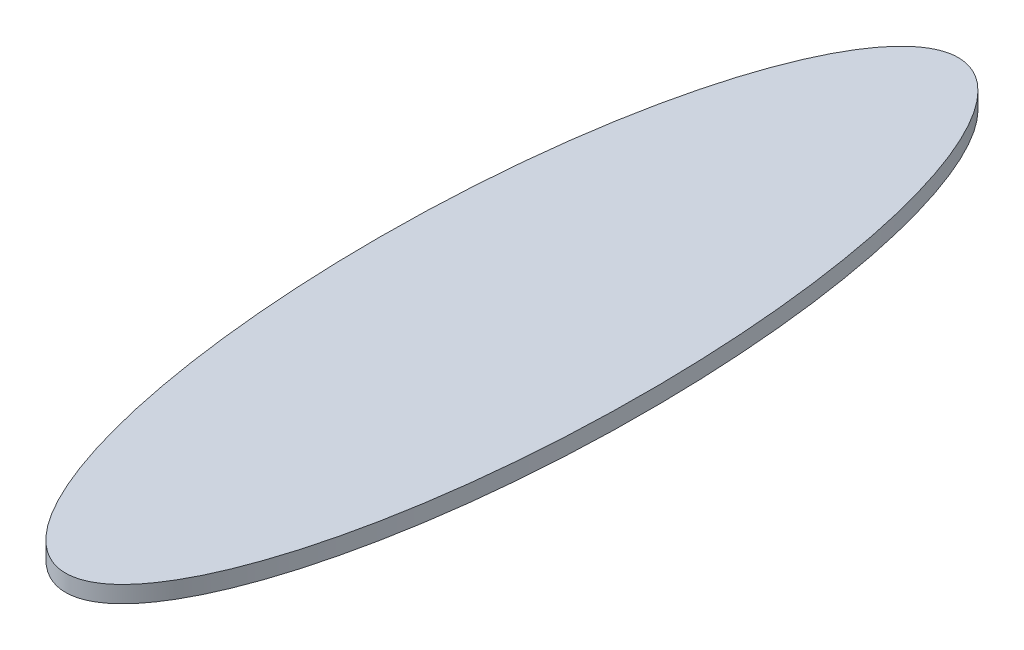
ISO-10303-21;
HEADER;
FILE_DESCRIPTION(('STEP AP214'),'2;1');
FILE_NAME('part.step','',(''),(''),'','','');
FILE_SCHEMA(('AUTOMOTIVE_DESIGN { 1 0 10303 214 1 1 1 1 }'));
ENDSEC;
DATA;
#1=APPLICATION_CONTEXT('core data for automotive mechanical design processes');
#2=APPLICATION_PROTOCOL_DEFINITION('international standard','automotive_design',2000,#1);
#3=PRODUCT_CONTEXT('',#1,'mechanical');
#4=PRODUCT('Part','Part','',(#3));
#5=PRODUCT_RELATED_PRODUCT_CATEGORY('part','',(#4));
#6=PRODUCT_DEFINITION_FORMATION('','',#4);
#7=PRODUCT_DEFINITION_CONTEXT('part definition',#1,'design');
#8=PRODUCT_DEFINITION('design','',#6,#7);
#9=PRODUCT_DEFINITION_SHAPE('','',#8);
#10=(LENGTH_UNIT() NAMED_UNIT(*) SI_UNIT(.MILLI.,.METRE.));
#11=(NAMED_UNIT(*) PLANE_ANGLE_UNIT() SI_UNIT($,.RADIAN.));
#12=(NAMED_UNIT(*) SI_UNIT($,.STERADIAN.) SOLID_ANGLE_UNIT());
#13=UNCERTAINTY_MEASURE_WITH_UNIT(LENGTH_MEASURE(1.E-05),#10,'distance_accuracy_value','');
#14=(GEOMETRIC_REPRESENTATION_CONTEXT(3) GLOBAL_UNCERTAINTY_ASSIGNED_CONTEXT((#13)) GLOBAL_UNIT_ASSIGNED_CONTEXT((#10,
#11,#12)) REPRESENTATION_CONTEXT('',''));
#15=CARTESIAN_POINT('',(0.,0.,0.));
#16=DIRECTION('',(0.,0.,1.));
#17=DIRECTION('',(1.,0.,0.));
#18=AXIS2_PLACEMENT_3D('',#15,#16,#17);
#19=CARTESIAN_POINT('',(0.,4.7625,0.));
#20=DIRECTION('',(0.,1.,0.));
#21=DIRECTION('',(0.,0.,-1.));
#22=AXIS2_PLACEMENT_3D('',#19,#20,#21);
#23=ELLIPSE('',#22,127.,38.1);
#24=DIRECTION('',(0.,-1.,0.));
#25=VECTOR('',#24,1.);
#26=SURFACE_OF_LINEAR_EXTRUSION('',#23,#25);
#27=CARTESIAN_POINT('',(0.,4.7625,-127.));
#28=VERTEX_POINT('',#27);
#29=EDGE_CURVE('E10',#28,#28,#23,.T.);
#30=ORIENTED_EDGE('',*,*,#29,.F.);
#31=EDGE_LOOP('',(#30));
#32=FACE_BOUND('',#31,.T.);
#33=CARTESIAN_POINT('',(0.,0.,0.));
#34=DIRECTION('',(0.,1.,0.));
#35=DIRECTION('',(0.,0.,-1.));
#36=AXIS2_PLACEMENT_3D('',#33,#34,#35);
#37=ELLIPSE('',#36,127.,38.1);
#38=CARTESIAN_POINT('',(0.,0.,-127.));
#39=VERTEX_POINT('',#38);
#40=EDGE_CURVE('E44',#39,#39,#37,.T.);
#41=ORIENTED_EDGE('',*,*,#40,.T.);
#42=EDGE_LOOP('',(#41));
#43=FACE_BOUND('',#42,.T.);
#44=ADVANCED_FACE('F40',(#32,#43),#26,.F.);
#45=CARTESIAN_POINT('',(0.,4.7625,0.));
#46=DIRECTION('',(0.,1.,0.));
#47=DIRECTION('',(0.,0.,1.));
#48=AXIS2_PLACEMENT_3D('',#45,#46,#47);
#49=PLANE('',#48);
#50=ORIENTED_EDGE('',*,*,#29,.T.);
#51=EDGE_LOOP('',(#50));
#52=FACE_BOUND('',#51,.T.);
#53=ADVANCED_FACE('F60',(#52),#49,.T.);
#54=CARTESIAN_POINT('',(0.,0.,0.));
#55=DIRECTION('',(0.,1.,0.));
#56=DIRECTION('',(0.,0.,1.));
#57=AXIS2_PLACEMENT_3D('',#54,#55,#56);
#58=PLANE('',#57);
#59=ORIENTED_EDGE('',*,*,#40,.F.);
#60=EDGE_LOOP('',(#59));
#61=FACE_BOUND('',#60,.T.);
#62=ADVANCED_FACE('F58',(#61),#58,.F.);
#63=CLOSED_SHELL('',(#44,#53,#62));
#64=MANIFOLD_SOLID_BREP('B2',#63);
#65=ADVANCED_BREP_SHAPE_REPRESENTATION('',(#18,#64),#14);
#66=SHAPE_DEFINITION_REPRESENTATION(#9,#65);
ENDSEC;
END-ISO-10303-21;
